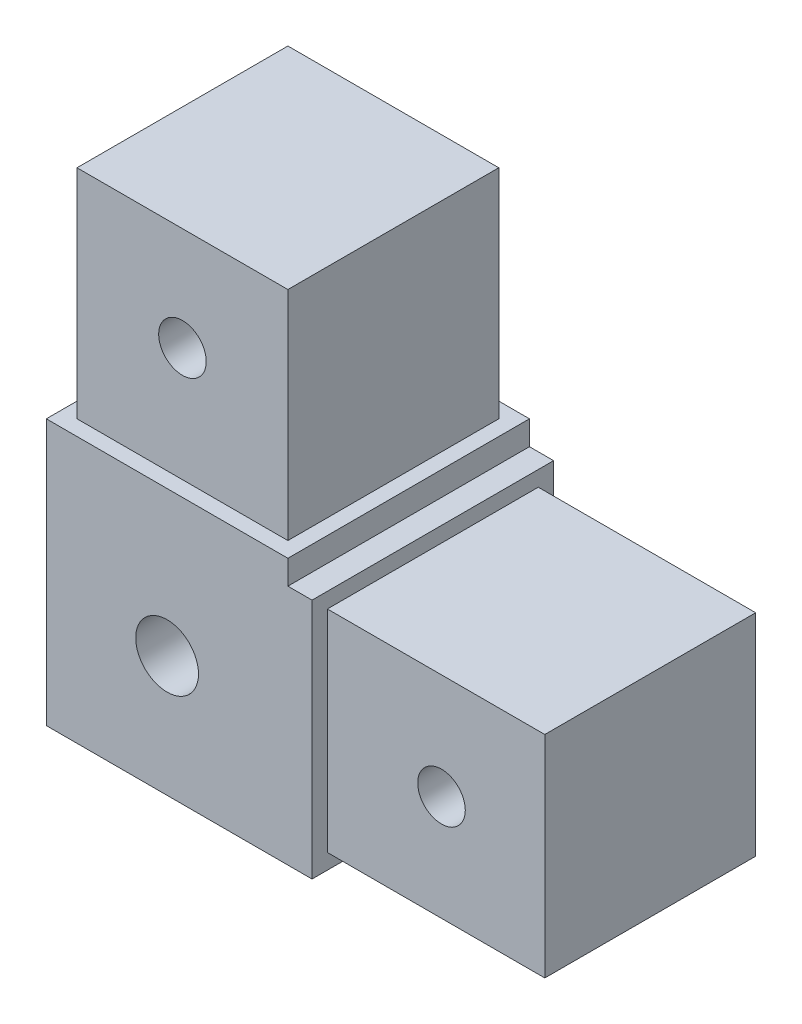
ISO-10303-21;
HEADER;
FILE_DESCRIPTION(('STEP AP214'),'2;1');
FILE_NAME('part.step','',(''),(''),'','','');
FILE_SCHEMA(('AUTOMOTIVE_DESIGN { 1 0 10303 214 1 1 1 1 }'));
ENDSEC;
DATA;
#1=APPLICATION_CONTEXT('core data for automotive mechanical design processes');
#2=APPLICATION_PROTOCOL_DEFINITION('international standard','automotive_design',2000,#1);
#3=PRODUCT_CONTEXT('',#1,'mechanical');
#4=PRODUCT('Part','Part','',(#3));
#5=PRODUCT_RELATED_PRODUCT_CATEGORY('part','',(#4));
#6=PRODUCT_DEFINITION_FORMATION('','',#4);
#7=PRODUCT_DEFINITION_CONTEXT('part definition',#1,'design');
#8=PRODUCT_DEFINITION('design','',#6,#7);
#9=PRODUCT_DEFINITION_SHAPE('','',#8);
#10=(LENGTH_UNIT() NAMED_UNIT(*) SI_UNIT(.MILLI.,.METRE.));
#11=(NAMED_UNIT(*) PLANE_ANGLE_UNIT() SI_UNIT($,.RADIAN.));
#12=(NAMED_UNIT(*) SI_UNIT($,.STERADIAN.) SOLID_ANGLE_UNIT());
#13=UNCERTAINTY_MEASURE_WITH_UNIT(LENGTH_MEASURE(1.E-05),#10,'distance_accuracy_value','');
#14=(GEOMETRIC_REPRESENTATION_CONTEXT(3) GLOBAL_UNCERTAINTY_ASSIGNED_CONTEXT((#13)) GLOBAL_UNIT_ASSIGNED_CONTEXT((#10,
#11,#12)) REPRESENTATION_CONTEXT('',''));
#15=CARTESIAN_POINT('',(0.,0.,0.));
#16=DIRECTION('',(0.,0.,1.));
#17=DIRECTION('',(1.,0.,0.));
#18=AXIS2_PLACEMENT_3D('',#15,#16,#17);
#19=CARTESIAN_POINT('',(-25.4,-25.4,12.7));
#20=DIRECTION('',(1.,0.,0.));
#21=DIRECTION('',(0.,0.,-1.));
#22=AXIS2_PLACEMENT_3D('',#19,#20,#21);
#23=PLANE('',#22);
#24=DIRECTION('',(0.,0.,1.));
#25=VECTOR('',#24,1.);
#26=CARTESIAN_POINT('',(-25.4,2.54,12.7));
#27=LINE('',#26,#25);
#28=CARTESIAN_POINT('',(-25.4,2.54,-12.7));
#29=VERTEX_POINT('',#28);
#30=CARTESIAN_POINT('',(-25.4,2.54,12.7));
#31=VERTEX_POINT('',#30);
#32=EDGE_CURVE('E184',#29,#31,#27,.T.);
#33=ORIENTED_EDGE('',*,*,#32,.F.);
#34=DIRECTION('',(0.,-1.,0.));
#35=VECTOR('',#34,1.);
#36=CARTESIAN_POINT('',(-25.4,-25.4,-12.7));
#37=LINE('',#36,#35);
#38=CARTESIAN_POINT('',(-25.4,-25.4,-12.7));
#39=VERTEX_POINT('',#38);
#40=EDGE_CURVE('E241',#29,#39,#37,.T.);
#41=ORIENTED_EDGE('',*,*,#40,.T.);
#42=DIRECTION('',(0.,0.,-1.));
#43=VECTOR('',#42,1.);
#44=CARTESIAN_POINT('',(-25.4,-25.4,12.7));
#45=LINE('',#44,#43);
#46=CARTESIAN_POINT('',(-25.4,-25.4,12.7));
#47=VERTEX_POINT('',#46);
#48=EDGE_CURVE('E11',#47,#39,#45,.T.);
#49=ORIENTED_EDGE('',*,*,#48,.F.);
#50=DIRECTION('',(0.,-1.,0.));
#51=VECTOR('',#50,1.);
#52=CARTESIAN_POINT('',(-25.4,-25.4,12.7));
#53=LINE('',#52,#51);
#54=EDGE_CURVE('E242',#31,#47,#53,.T.);
#55=ORIENTED_EDGE('',*,*,#54,.F.);
#56=EDGE_LOOP('',(#33,#41,#49,#55));
#57=FACE_BOUND('',#56,.T.);
#58=ADVANCED_FACE('F35',(#57),#23,.F.);
#59=CARTESIAN_POINT('',(0.,0.,12.7));
#60=DIRECTION('',(0.,0.,-1.));
#61=DIRECTION('',(-1.,0.,0.));
#62=AXIS2_PLACEMENT_3D('',#59,#60,#61);
#63=PLANE('',#62);
#64=CARTESIAN_POINT('',(-12.7,-12.7,12.7));
#65=DIRECTION('',(0.,0.,1.));
#66=DIRECTION('',(1.,0.,0.));
#67=AXIS2_PLACEMENT_3D('',#64,#65,#66);
#68=CIRCLE('',#67,3.3);
#69=CARTESIAN_POINT('',(-9.40000000000001,-12.7,12.7));
#70=VERTEX_POINT('',#69);
#71=EDGE_CURVE('E166',#70,#70,#68,.T.);
#72=ORIENTED_EDGE('',*,*,#71,.F.);
#73=EDGE_LOOP('',(#72));
#74=FACE_BOUND('',#73,.T.);
#75=DIRECTION('',(1.,0.,0.));
#76=VECTOR('',#75,1.);
#77=CARTESIAN_POINT('',(0.,2.54,12.7));
#78=LINE('',#77,#76);
#79=CARTESIAN_POINT('',(0.,2.54,12.7));
#80=VERTEX_POINT('',#79);
#81=EDGE_CURVE('E58',#31,#80,#78,.T.);
#82=ORIENTED_EDGE('',*,*,#81,.F.);
#83=ORIENTED_EDGE('',*,*,#54,.T.);
#84=DIRECTION('',(1.,0.,0.));
#85=VECTOR('',#84,1.);
#86=CARTESIAN_POINT('',(-25.4,-25.4,12.7));
#87=LINE('',#86,#85);
#88=CARTESIAN_POINT('',(2.53999999999999,-25.4,12.7));
#89=VERTEX_POINT('',#88);
#90=EDGE_CURVE('E43',#47,#89,#87,.T.);
#91=ORIENTED_EDGE('',*,*,#90,.T.);
#92=DIRECTION('',(0.,-1.,0.));
#93=VECTOR('',#92,1.);
#94=CARTESIAN_POINT('',(2.53999999999999,-25.4,12.7));
#95=LINE('',#94,#93);
#96=CARTESIAN_POINT('',(2.53999999999999,0.,12.7));
#97=VERTEX_POINT('',#96);
#98=EDGE_CURVE('E214',#97,#89,#95,.T.);
#99=ORIENTED_EDGE('',*,*,#98,.F.);
#100=DIRECTION('',(1.,0.,0.));
#101=VECTOR('',#100,1.);
#102=CARTESIAN_POINT('',(25.4,0.,12.7));
#103=LINE('',#102,#101);
#104=CARTESIAN_POINT('',(0.,0.,12.7));
#105=VERTEX_POINT('',#104);
#106=EDGE_CURVE('E232',#105,#97,#103,.T.);
#107=ORIENTED_EDGE('',*,*,#106,.F.);
#108=DIRECTION('',(0.,-1.,0.));
#109=VECTOR('',#108,1.);
#110=CARTESIAN_POINT('',(0.,25.4,12.7));
#111=LINE('',#110,#109);
#112=EDGE_CURVE('E228',#80,#105,#111,.T.);
#113=ORIENTED_EDGE('',*,*,#112,.F.);
#114=EDGE_LOOP('',(#82,#83,#91,#99,#107,#113));
#115=FACE_BOUND('',#114,.T.);
#116=ADVANCED_FACE('F270',(#74,#115),#63,.F.);
#117=CARTESIAN_POINT('',(0.,0.,-12.7));
#118=DIRECTION('',(0.,0.,-1.));
#119=DIRECTION('',(-1.,0.,0.));
#120=AXIS2_PLACEMENT_3D('',#117,#118,#119);
#121=PLANE('',#120);
#122=CARTESIAN_POINT('',(-12.7,-12.7,-12.7));
#123=DIRECTION('',(0.,0.,1.));
#124=DIRECTION('',(1.,0.,0.));
#125=AXIS2_PLACEMENT_3D('',#122,#123,#124);
#126=CIRCLE('',#125,3.3);
#127=CARTESIAN_POINT('',(-9.40000000000001,-12.7,-12.7));
#128=VERTEX_POINT('',#127);
#129=EDGE_CURVE('E173',#128,#128,#126,.T.);
#130=ORIENTED_EDGE('',*,*,#129,.T.);
#131=EDGE_LOOP('',(#130));
#132=FACE_BOUND('',#131,.T.);
#133=ORIENTED_EDGE('',*,*,#40,.F.);
#134=DIRECTION('',(-1.,0.,0.));
#135=VECTOR('',#134,1.);
#136=CARTESIAN_POINT('',(0.,2.54,-12.7));
#137=LINE('',#136,#135);
#138=CARTESIAN_POINT('',(0.,2.54,-12.7));
#139=VERTEX_POINT('',#138);
#140=EDGE_CURVE('E182',#139,#29,#137,.T.);
#141=ORIENTED_EDGE('',*,*,#140,.F.);
#142=DIRECTION('',(0.,-1.,0.));
#143=VECTOR('',#142,1.);
#144=CARTESIAN_POINT('',(0.,25.4,-12.7));
#145=LINE('',#144,#143);
#146=CARTESIAN_POINT('',(0.,0.,-12.7));
#147=VERTEX_POINT('',#146);
#148=EDGE_CURVE('E229',#139,#147,#145,.T.);
#149=ORIENTED_EDGE('',*,*,#148,.T.);
#150=DIRECTION('',(1.,0.,0.));
#151=VECTOR('',#150,1.);
#152=CARTESIAN_POINT('',(25.4,0.,-12.7));
#153=LINE('',#152,#151);
#154=CARTESIAN_POINT('',(2.53999999999999,0.,-12.7));
#155=VERTEX_POINT('',#154);
#156=EDGE_CURVE('E231',#147,#155,#153,.T.);
#157=ORIENTED_EDGE('',*,*,#156,.T.);
#158=DIRECTION('',(0.,1.,0.));
#159=VECTOR('',#158,1.);
#160=CARTESIAN_POINT('',(2.53999999999999,-25.4,-12.7));
#161=LINE('',#160,#159);
#162=CARTESIAN_POINT('',(2.53999999999999,-25.4,-12.7));
#163=VERTEX_POINT('',#162);
#164=EDGE_CURVE('E224',#163,#155,#161,.T.);
#165=ORIENTED_EDGE('',*,*,#164,.F.);
#166=DIRECTION('',(1.,0.,0.));
#167=VECTOR('',#166,1.);
#168=CARTESIAN_POINT('',(-25.4,-25.4,-12.7));
#169=LINE('',#168,#167);
#170=EDGE_CURVE('E244',#39,#163,#169,.T.);
#171=ORIENTED_EDGE('',*,*,#170,.F.);
#172=EDGE_LOOP('',(#133,#141,#149,#157,#165,#171));
#173=FACE_BOUND('',#172,.T.);
#174=ADVANCED_FACE('F257',(#132,#173),#121,.T.);
#175=CARTESIAN_POINT('',(0.,25.4,-12.7));
#176=DIRECTION('',(-1.,0.,0.));
#177=DIRECTION('',(0.,0.,1.));
#178=AXIS2_PLACEMENT_3D('',#175,#176,#177);
#179=PLANE('',#178);
#180=DIRECTION('',(0.,0.,-1.));
#181=VECTOR('',#180,1.);
#182=CARTESIAN_POINT('',(0.,2.54,12.7));
#183=LINE('',#182,#181);
#184=EDGE_CURVE('E177',#80,#139,#183,.T.);
#185=ORIENTED_EDGE('',*,*,#184,.F.);
#186=ORIENTED_EDGE('',*,*,#112,.T.);
#187=DIRECTION('',(0.,0.,1.));
#188=VECTOR('',#187,1.);
#189=CARTESIAN_POINT('',(0.,0.,-12.7));
#190=LINE('',#189,#188);
#191=EDGE_CURVE('E235',#147,#105,#190,.T.);
#192=ORIENTED_EDGE('',*,*,#191,.F.);
#193=ORIENTED_EDGE('',*,*,#148,.F.);
#194=EDGE_LOOP('',(#185,#186,#192,#193));
#195=FACE_BOUND('',#194,.T.);
#196=ADVANCED_FACE('F276',(#195),#179,.F.);
#197=CARTESIAN_POINT('',(-25.4,-25.4,12.7));
#198=DIRECTION('',(0.,1.,0.));
#199=DIRECTION('',(0.,0.,1.));
#200=AXIS2_PLACEMENT_3D('',#197,#198,#199);
#201=PLANE('',#200);
#202=ORIENTED_EDGE('',*,*,#170,.T.);
#203=DIRECTION('',(0.,0.,-1.));
#204=VECTOR('',#203,1.);
#205=CARTESIAN_POINT('',(2.53999999999999,-25.4,12.7));
#206=LINE('',#205,#204);
#207=EDGE_CURVE('E222',#89,#163,#206,.T.);
#208=ORIENTED_EDGE('',*,*,#207,.F.);
#209=ORIENTED_EDGE('',*,*,#90,.F.);
#210=ORIENTED_EDGE('',*,*,#48,.T.);
#211=EDGE_LOOP('',(#202,#208,#209,#210));
#212=FACE_BOUND('',#211,.T.);
#213=ADVANCED_FACE('F251',(#212),#201,.F.);
#214=CARTESIAN_POINT('',(25.4,0.,-12.7));
#215=DIRECTION('',(0.,-1.,0.));
#216=DIRECTION('',(0.,0.,-1.));
#217=AXIS2_PLACEMENT_3D('',#214,#215,#216);
#218=PLANE('',#217);
#219=ORIENTED_EDGE('',*,*,#106,.T.);
#220=DIRECTION('',(0.,0.,1.));
#221=VECTOR('',#220,1.);
#222=CARTESIAN_POINT('',(2.53999999999999,0.,12.7));
#223=LINE('',#222,#221);
#224=EDGE_CURVE('E226',#155,#97,#223,.T.);
#225=ORIENTED_EDGE('',*,*,#224,.F.);
#226=ORIENTED_EDGE('',*,*,#156,.F.);
#227=ORIENTED_EDGE('',*,*,#191,.T.);
#228=EDGE_LOOP('',(#219,#225,#226,#227));
#229=FACE_BOUND('',#228,.T.);
#230=ADVANCED_FACE('F265',(#229),#218,.F.);
#231=CARTESIAN_POINT('',(2.53999999999999,0.,0.));
#232=DIRECTION('',(-1.,0.,0.));
#233=DIRECTION('',(0.,0.,1.));
#234=AXIS2_PLACEMENT_3D('',#231,#232,#233);
#235=PLANE('',#234);
#236=DIRECTION('',(0.,0.,-1.));
#237=VECTOR('',#236,1.);
#238=CARTESIAN_POINT('',(2.53999999999999,-23.7871,11.0871));
#239=LINE('',#238,#237);
#240=CARTESIAN_POINT('',(2.53999999999999,-23.7871,11.0871));
#241=VERTEX_POINT('',#240);
#242=CARTESIAN_POINT('',(2.53999999999999,-23.7871,-11.0871));
#243=VERTEX_POINT('',#242);
#244=EDGE_CURVE('E188',#241,#243,#239,.T.);
#245=ORIENTED_EDGE('',*,*,#244,.F.);
#246=DIRECTION('',(0.,-1.,0.));
#247=VECTOR('',#246,1.);
#248=CARTESIAN_POINT('',(2.53999999999999,-23.7871,11.0871));
#249=LINE('',#248,#247);
#250=CARTESIAN_POINT('',(2.53999999999999,-1.6129,11.0871));
#251=VERTEX_POINT('',#250);
#252=EDGE_CURVE('E198',#251,#241,#249,.T.);
#253=ORIENTED_EDGE('',*,*,#252,.F.);
#254=DIRECTION('',(0.,0.,1.));
#255=VECTOR('',#254,1.);
#256=CARTESIAN_POINT('',(2.53999999999999,-1.6129,11.0871));
#257=LINE('',#256,#255);
#258=CARTESIAN_POINT('',(2.53999999999999,-1.6129,-11.0871));
#259=VERTEX_POINT('',#258);
#260=EDGE_CURVE('E195',#259,#251,#257,.T.);
#261=ORIENTED_EDGE('',*,*,#260,.F.);
#262=DIRECTION('',(0.,1.,0.));
#263=VECTOR('',#262,1.);
#264=CARTESIAN_POINT('',(2.53999999999999,-23.7871,-11.0871));
#265=LINE('',#264,#263);
#266=EDGE_CURVE('E191',#243,#259,#265,.T.);
#267=ORIENTED_EDGE('',*,*,#266,.F.);
#268=EDGE_LOOP('',(#245,#253,#261,#267));
#269=FACE_BOUND('',#268,.T.);
#270=ORIENTED_EDGE('',*,*,#98,.T.);
#271=ORIENTED_EDGE('',*,*,#207,.T.);
#272=ORIENTED_EDGE('',*,*,#164,.T.);
#273=ORIENTED_EDGE('',*,*,#224,.T.);
#274=EDGE_LOOP('',(#270,#271,#272,#273));
#275=FACE_BOUND('',#274,.T.);
#276=ADVANCED_FACE('F262',(#269,#275),#235,.F.);
#277=CARTESIAN_POINT('',(2.53999999999999,-23.7871,11.0871));
#278=DIRECTION('',(0.,-1.,0.));
#279=DIRECTION('',(0.,0.,-1.));
#280=AXIS2_PLACEMENT_3D('',#277,#278,#279);
#281=PLANE('',#280);
#282=DIRECTION('',(0.,0.,-1.));
#283=VECTOR('',#282,1.);
#284=CARTESIAN_POINT('',(25.4,-23.7871,11.0871));
#285=LINE('',#284,#283);
#286=CARTESIAN_POINT('',(25.4,-23.7871,11.0871));
#287=VERTEX_POINT('',#286);
#288=CARTESIAN_POINT('',(25.4,-23.7871,-11.0871));
#289=VERTEX_POINT('',#288);
#290=EDGE_CURVE('E187',#287,#289,#285,.T.);
#291=ORIENTED_EDGE('',*,*,#290,.F.);
#292=DIRECTION('',(1.,0.,0.));
#293=VECTOR('',#292,1.);
#294=CARTESIAN_POINT('',(2.53999999999999,-23.7871,11.0871));
#295=LINE('',#294,#293);
#296=EDGE_CURVE('E212',#241,#287,#295,.T.);
#297=ORIENTED_EDGE('',*,*,#296,.F.);
#298=ORIENTED_EDGE('',*,*,#244,.T.);
#299=DIRECTION('',(1.,0.,0.));
#300=VECTOR('',#299,1.);
#301=CARTESIAN_POINT('',(2.53999999999999,-23.7871,-11.0871));
#302=LINE('',#301,#300);
#303=EDGE_CURVE('E201',#243,#289,#302,.T.);
#304=ORIENTED_EDGE('',*,*,#303,.T.);
#305=EDGE_LOOP('',(#291,#297,#298,#304));
#306=FACE_BOUND('',#305,.T.);
#307=ADVANCED_FACE('F327',(#306),#281,.T.);
#308=CARTESIAN_POINT('',(2.53999999999999,-23.7871,11.0871));
#309=DIRECTION('',(0.,0.,1.));
#310=DIRECTION('',(1.,0.,0.));
#311=AXIS2_PLACEMENT_3D('',#308,#309,#310);
#312=PLANE('',#311);
#313=CARTESIAN_POINT('',(14.54,-12.6979,11.0871));
#314=DIRECTION('',(0.,0.,1.));
#315=DIRECTION('',(1.,0.,0.));
#316=AXIS2_PLACEMENT_3D('',#313,#314,#315);
#317=CIRCLE('',#316,2.5);
#318=CARTESIAN_POINT('',(17.04,-12.6979,11.0871));
#319=VERTEX_POINT('',#318);
#320=EDGE_CURVE('E422',#319,#319,#317,.T.);
#321=ORIENTED_EDGE('',*,*,#320,.F.);
#322=EDGE_LOOP('',(#321));
#323=FACE_BOUND('',#322,.T.);
#324=DIRECTION('',(0.,-1.,0.));
#325=VECTOR('',#324,1.);
#326=CARTESIAN_POINT('',(25.4,-23.7871,11.0871));
#327=LINE('',#326,#325);
#328=CARTESIAN_POINT('',(25.4,-1.6129,11.0871));
#329=VERTEX_POINT('',#328);
#330=EDGE_CURVE('E192',#329,#287,#327,.T.);
#331=ORIENTED_EDGE('',*,*,#330,.F.);
#332=DIRECTION('',(1.,0.,0.));
#333=VECTOR('',#332,1.);
#334=CARTESIAN_POINT('',(2.53999999999999,-1.6129,11.0871));
#335=LINE('',#334,#333);
#336=EDGE_CURVE('E215',#251,#329,#335,.T.);
#337=ORIENTED_EDGE('',*,*,#336,.F.);
#338=ORIENTED_EDGE('',*,*,#252,.T.);
#339=ORIENTED_EDGE('',*,*,#296,.T.);
#340=EDGE_LOOP('',(#331,#337,#338,#339));
#341=FACE_BOUND('',#340,.T.);
#342=ADVANCED_FACE('F323',(#323,#341),#312,.T.);
#343=CARTESIAN_POINT('',(2.53999999999999,-1.6129,11.0871));
#344=DIRECTION('',(0.,1.,0.));
#345=DIRECTION('',(0.,0.,1.));
#346=AXIS2_PLACEMENT_3D('',#343,#344,#345);
#347=PLANE('',#346);
#348=DIRECTION('',(0.,0.,1.));
#349=VECTOR('',#348,1.);
#350=CARTESIAN_POINT('',(25.4,-1.6129,11.0871));
#351=LINE('',#350,#349);
#352=CARTESIAN_POINT('',(25.4,-1.6129,-11.0871));
#353=VERTEX_POINT('',#352);
#354=EDGE_CURVE('E207',#353,#329,#351,.T.);
#355=ORIENTED_EDGE('',*,*,#354,.F.);
#356=DIRECTION('',(1.,0.,0.));
#357=VECTOR('',#356,1.);
#358=CARTESIAN_POINT('',(2.53999999999999,-1.6129,-11.0871));
#359=LINE('',#358,#357);
#360=EDGE_CURVE('E217',#259,#353,#359,.T.);
#361=ORIENTED_EDGE('',*,*,#360,.F.);
#362=ORIENTED_EDGE('',*,*,#260,.T.);
#363=ORIENTED_EDGE('',*,*,#336,.T.);
#364=EDGE_LOOP('',(#355,#361,#362,#363));
#365=FACE_BOUND('',#364,.T.);
#366=ADVANCED_FACE('F326',(#365),#347,.T.);
#367=CARTESIAN_POINT('',(2.53999999999999,-23.7871,-11.0871));
#368=DIRECTION('',(0.,0.,-1.));
#369=DIRECTION('',(-1.,0.,0.));
#370=AXIS2_PLACEMENT_3D('',#367,#368,#369);
#371=PLANE('',#370);
#372=CARTESIAN_POINT('',(14.54,-12.6979,-11.0871));
#373=DIRECTION('',(0.,0.,-1.));
#374=DIRECTION('',(-1.,0.,0.));
#375=AXIS2_PLACEMENT_3D('',#372,#373,#374);
#376=CIRCLE('',#375,2.5);
#377=CARTESIAN_POINT('',(12.04,-12.6979,-11.0871));
#378=VERTEX_POINT('',#377);
#379=EDGE_CURVE('E419',#378,#378,#376,.T.);
#380=ORIENTED_EDGE('',*,*,#379,.F.);
#381=EDGE_LOOP('',(#380));
#382=FACE_BOUND('',#381,.T.);
#383=DIRECTION('',(0.,1.,0.));
#384=VECTOR('',#383,1.);
#385=CARTESIAN_POINT('',(25.4,-23.7871,-11.0871));
#386=LINE('',#385,#384);
#387=EDGE_CURVE('E204',#289,#353,#386,.T.);
#388=ORIENTED_EDGE('',*,*,#387,.F.);
#389=ORIENTED_EDGE('',*,*,#303,.F.);
#390=ORIENTED_EDGE('',*,*,#266,.T.);
#391=ORIENTED_EDGE('',*,*,#360,.T.);
#392=EDGE_LOOP('',(#388,#389,#390,#391));
#393=FACE_BOUND('',#392,.T.);
#394=ADVANCED_FACE('F331',(#382,#393),#371,.T.);
#395=CARTESIAN_POINT('',(25.4,-25.4,12.7));
#396=DIRECTION('',(-1.,0.,0.));
#397=DIRECTION('',(0.,0.,1.));
#398=AXIS2_PLACEMENT_3D('',#395,#396,#397);
#399=PLANE('',#398);
#400=ORIENTED_EDGE('',*,*,#290,.T.);
#401=ORIENTED_EDGE('',*,*,#387,.T.);
#402=ORIENTED_EDGE('',*,*,#354,.T.);
#403=ORIENTED_EDGE('',*,*,#330,.T.);
#404=EDGE_LOOP('',(#400,#401,#402,#403));
#405=FACE_BOUND('',#404,.T.);
#406=ADVANCED_FACE('F37',(#405),#399,.F.);
#407=CARTESIAN_POINT('',(0.,2.54,0.));
#408=DIRECTION('',(0.,1.,0.));
#409=DIRECTION('',(0.,0.,1.));
#410=AXIS2_PLACEMENT_3D('',#407,#408,#409);
#411=PLANE('',#410);
#412=DIRECTION('',(1.,0.,0.));
#413=VECTOR('',#412,1.);
#414=CARTESIAN_POINT('',(-1.6129,2.54,11.0871));
#415=LINE('',#414,#413);
#416=CARTESIAN_POINT('',(-23.7871,2.54,11.0871));
#417=VERTEX_POINT('',#416);
#418=CARTESIAN_POINT('',(-1.6129,2.54,11.0871));
#419=VERTEX_POINT('',#418);
#420=EDGE_CURVE('E148',#417,#419,#415,.T.);
#421=ORIENTED_EDGE('',*,*,#420,.F.);
#422=DIRECTION('',(0.,0.,1.));
#423=VECTOR('',#422,1.);
#424=CARTESIAN_POINT('',(-23.7871,2.54,11.0871));
#425=LINE('',#424,#423);
#426=CARTESIAN_POINT('',(-23.7871,2.54,-11.0871));
#427=VERTEX_POINT('',#426);
#428=EDGE_CURVE('E157',#427,#417,#425,.T.);
#429=ORIENTED_EDGE('',*,*,#428,.F.);
#430=DIRECTION('',(-1.,0.,0.));
#431=VECTOR('',#430,1.);
#432=CARTESIAN_POINT('',(-1.6129,2.54,-11.0871));
#433=LINE('',#432,#431);
#434=CARTESIAN_POINT('',(-1.6129,2.54,-11.0871));
#435=VERTEX_POINT('',#434);
#436=EDGE_CURVE('E140',#435,#427,#433,.T.);
#437=ORIENTED_EDGE('',*,*,#436,.F.);
#438=DIRECTION('',(0.,0.,-1.));
#439=VECTOR('',#438,1.);
#440=CARTESIAN_POINT('',(-1.6129,2.54,11.0871));
#441=LINE('',#440,#439);
#442=EDGE_CURVE('E154',#419,#435,#441,.T.);
#443=ORIENTED_EDGE('',*,*,#442,.F.);
#444=EDGE_LOOP('',(#421,#429,#437,#443));
#445=FACE_BOUND('',#444,.T.);
#446=ORIENTED_EDGE('',*,*,#184,.T.);
#447=ORIENTED_EDGE('',*,*,#140,.T.);
#448=ORIENTED_EDGE('',*,*,#32,.T.);
#449=ORIENTED_EDGE('',*,*,#81,.T.);
#450=EDGE_LOOP('',(#446,#447,#448,#449));
#451=FACE_BOUND('',#450,.T.);
#452=ADVANCED_FACE('F153',(#445,#451),#411,.T.);
#453=CARTESIAN_POINT('',(-1.6129,2.54,11.0871));
#454=DIRECTION('',(1.,0.,0.));
#455=DIRECTION('',(0.,0.,-1.));
#456=AXIS2_PLACEMENT_3D('',#453,#454,#455);
#457=PLANE('',#456);
#458=DIRECTION('',(0.,0.,-1.));
#459=VECTOR('',#458,1.);
#460=CARTESIAN_POINT('',(-1.6129,25.4,11.0871));
#461=LINE('',#460,#459);
#462=CARTESIAN_POINT('',(-1.6129,25.4,11.0871));
#463=VERTEX_POINT('',#462);
#464=CARTESIAN_POINT('',(-1.6129,25.4,-11.0871));
#465=VERTEX_POINT('',#464);
#466=EDGE_CURVE('E171',#463,#465,#461,.T.);
#467=ORIENTED_EDGE('',*,*,#466,.F.);
#468=DIRECTION('',(0.,1.,0.));
#469=VECTOR('',#468,1.);
#470=CARTESIAN_POINT('',(-1.6129,2.54,11.0871));
#471=LINE('',#470,#469);
#472=EDGE_CURVE('E160',#419,#463,#471,.T.);
#473=ORIENTED_EDGE('',*,*,#472,.F.);
#474=ORIENTED_EDGE('',*,*,#442,.T.);
#475=DIRECTION('',(0.,1.,0.));
#476=VECTOR('',#475,1.);
#477=CARTESIAN_POINT('',(-1.6129,2.54,-11.0871));
#478=LINE('',#477,#476);
#479=EDGE_CURVE('E137',#435,#465,#478,.T.);
#480=ORIENTED_EDGE('',*,*,#479,.T.);
#481=EDGE_LOOP('',(#467,#473,#474,#480));
#482=FACE_BOUND('',#481,.T.);
#483=ADVANCED_FACE('F159',(#482),#457,.T.);
#484=CARTESIAN_POINT('',(-1.6129,2.54,11.0871));
#485=DIRECTION('',(0.,0.,1.));
#486=DIRECTION('',(1.,0.,0.));
#487=AXIS2_PLACEMENT_3D('',#484,#485,#486);
#488=PLANE('',#487);
#489=CARTESIAN_POINT('',(-12.6979,14.54,11.0871));
#490=DIRECTION('',(0.,0.,1.));
#491=DIRECTION('',(1.,0.,0.));
#492=AXIS2_PLACEMENT_3D('',#489,#490,#491);
#493=CIRCLE('',#492,2.5);
#494=CARTESIAN_POINT('',(-10.1979,14.54,11.0871));
#495=VERTEX_POINT('',#494);
#496=EDGE_CURVE('E424',#495,#495,#493,.T.);
#497=ORIENTED_EDGE('',*,*,#496,.F.);
#498=EDGE_LOOP('',(#497));
#499=FACE_BOUND('',#498,.T.);
#500=DIRECTION('',(1.,0.,0.));
#501=VECTOR('',#500,1.);
#502=CARTESIAN_POINT('',(-1.6129,25.4,11.0871));
#503=LINE('',#502,#501);
#504=CARTESIAN_POINT('',(-23.7871,25.4,11.0871));
#505=VERTEX_POINT('',#504);
#506=EDGE_CURVE('E161',#505,#463,#503,.T.);
#507=ORIENTED_EDGE('',*,*,#506,.F.);
#508=DIRECTION('',(0.,1.,0.));
#509=VECTOR('',#508,1.);
#510=CARTESIAN_POINT('',(-23.7871,2.54,11.0871));
#511=LINE('',#510,#509);
#512=EDGE_CURVE('E178',#417,#505,#511,.T.);
#513=ORIENTED_EDGE('',*,*,#512,.F.);
#514=ORIENTED_EDGE('',*,*,#420,.T.);
#515=ORIENTED_EDGE('',*,*,#472,.T.);
#516=EDGE_LOOP('',(#507,#513,#514,#515));
#517=FACE_BOUND('',#516,.T.);
#518=ADVANCED_FACE('F310',(#499,#517),#488,.T.);
#519=CARTESIAN_POINT('',(-23.7871,2.54,11.0871));
#520=DIRECTION('',(-1.,0.,0.));
#521=DIRECTION('',(0.,0.,1.));
#522=AXIS2_PLACEMENT_3D('',#519,#520,#521);
#523=PLANE('',#522);
#524=DIRECTION('',(0.,0.,1.));
#525=VECTOR('',#524,1.);
#526=CARTESIAN_POINT('',(-23.7871,25.4,11.0871));
#527=LINE('',#526,#525);
#528=CARTESIAN_POINT('',(-23.7871,25.4,-11.0871));
#529=VERTEX_POINT('',#528);
#530=EDGE_CURVE('E50',#529,#505,#527,.T.);
#531=ORIENTED_EDGE('',*,*,#530,.F.);
#532=DIRECTION('',(0.,1.,0.));
#533=VECTOR('',#532,1.);
#534=CARTESIAN_POINT('',(-23.7871,2.54,-11.0871));
#535=LINE('',#534,#533);
#536=EDGE_CURVE('E147',#427,#529,#535,.T.);
#537=ORIENTED_EDGE('',*,*,#536,.F.);
#538=ORIENTED_EDGE('',*,*,#428,.T.);
#539=ORIENTED_EDGE('',*,*,#512,.T.);
#540=EDGE_LOOP('',(#531,#537,#538,#539));
#541=FACE_BOUND('',#540,.T.);
#542=ADVANCED_FACE('F305',(#541),#523,.T.);
#543=CARTESIAN_POINT('',(-1.6129,2.54,-11.0871));
#544=DIRECTION('',(0.,0.,-1.));
#545=DIRECTION('',(-1.,0.,0.));
#546=AXIS2_PLACEMENT_3D('',#543,#544,#545);
#547=PLANE('',#546);
#548=CARTESIAN_POINT('',(-12.6979,14.54,-11.0871));
#549=DIRECTION('',(0.,0.,-1.));
#550=DIRECTION('',(-1.,0.,0.));
#551=AXIS2_PLACEMENT_3D('',#548,#549,#550);
#552=CIRCLE('',#551,2.5);
#553=CARTESIAN_POINT('',(-15.1979,14.54,-11.0871));
#554=VERTEX_POINT('',#553);
#555=EDGE_CURVE('E429',#554,#554,#552,.T.);
#556=ORIENTED_EDGE('',*,*,#555,.F.);
#557=EDGE_LOOP('',(#556));
#558=FACE_BOUND('',#557,.T.);
#559=DIRECTION('',(-1.,0.,0.));
#560=VECTOR('',#559,1.);
#561=CARTESIAN_POINT('',(-1.6129,25.4,-11.0871));
#562=LINE('',#561,#560);
#563=EDGE_CURVE('E142',#465,#529,#562,.T.);
#564=ORIENTED_EDGE('',*,*,#563,.F.);
#565=ORIENTED_EDGE('',*,*,#479,.F.);
#566=ORIENTED_EDGE('',*,*,#436,.T.);
#567=ORIENTED_EDGE('',*,*,#536,.T.);
#568=EDGE_LOOP('',(#564,#565,#566,#567));
#569=FACE_BOUND('',#568,.T.);
#570=ADVANCED_FACE('F139',(#558,#569),#547,.T.);
#571=CARTESIAN_POINT('',(-25.4,25.4,12.7));
#572=DIRECTION('',(0.,-1.,0.));
#573=DIRECTION('',(0.,0.,-1.));
#574=AXIS2_PLACEMENT_3D('',#571,#572,#573);
#575=PLANE('',#574);
#576=ORIENTED_EDGE('',*,*,#466,.T.);
#577=ORIENTED_EDGE('',*,*,#563,.T.);
#578=ORIENTED_EDGE('',*,*,#530,.T.);
#579=ORIENTED_EDGE('',*,*,#506,.T.);
#580=EDGE_LOOP('',(#576,#577,#578,#579));
#581=FACE_BOUND('',#580,.T.);
#582=ADVANCED_FACE('F294',(#581),#575,.F.);
#583=CARTESIAN_POINT('',(-12.7,-12.7,-12.7));
#584=DIRECTION('',(0.,0.,1.));
#585=DIRECTION('',(1.,0.,0.));
#586=AXIS2_PLACEMENT_3D('',#583,#584,#585);
#587=CYLINDRICAL_SURFACE('',#586,3.3);
#588=ORIENTED_EDGE('',*,*,#129,.F.);
#589=EDGE_LOOP('',(#588));
#590=FACE_BOUND('',#589,.T.);
#591=ORIENTED_EDGE('',*,*,#71,.T.);
#592=EDGE_LOOP('',(#591));
#593=FACE_BOUND('',#592,.T.);
#594=ADVANCED_FACE('F296',(#590,#593),#587,.F.);
#595=CARTESIAN_POINT('',(-12.6979,14.54,11.0871));
#596=DIRECTION('',(0.,0.,1.));
#597=DIRECTION('',(1.,0.,0.));
#598=AXIS2_PLACEMENT_3D('',#595,#596,#597);
#599=CYLINDRICAL_SURFACE('',#598,2.5);
#600=ORIENTED_EDGE('',*,*,#555,.T.);
#601=EDGE_LOOP('',(#600));
#602=FACE_BOUND('',#601,.T.);
#603=ORIENTED_EDGE('',*,*,#496,.T.);
#604=EDGE_LOOP('',(#603));
#605=FACE_BOUND('',#604,.T.);
#606=ADVANCED_FACE('F302',(#602,#605),#599,.F.);
#607=CARTESIAN_POINT('',(14.54,-12.6979,11.0871));
#608=DIRECTION('',(0.,0.,1.));
#609=DIRECTION('',(1.,0.,0.));
#610=AXIS2_PLACEMENT_3D('',#607,#608,#609);
#611=CYLINDRICAL_SURFACE('',#610,2.5);
#612=ORIENTED_EDGE('',*,*,#379,.T.);
#613=EDGE_LOOP('',(#612));
#614=FACE_BOUND('',#613,.T.);
#615=ORIENTED_EDGE('',*,*,#320,.T.);
#616=EDGE_LOOP('',(#615));
#617=FACE_BOUND('',#616,.T.);
#618=ADVANCED_FACE('F402',(#614,#617),#611,.F.);
#619=CLOSED_SHELL('',(#58,#116,#174,#196,#213,#230,#276,#307,#342,#366,#394,#406,#452,#483,#518,
#542,#570,#582,#594,#606,#618));
#620=MANIFOLD_SOLID_BREP('B2',#619);
#621=ADVANCED_BREP_SHAPE_REPRESENTATION('',(#18,#620),#14);
#622=SHAPE_DEFINITION_REPRESENTATION(#9,#621);
ENDSEC;
END-ISO-10303-21;
